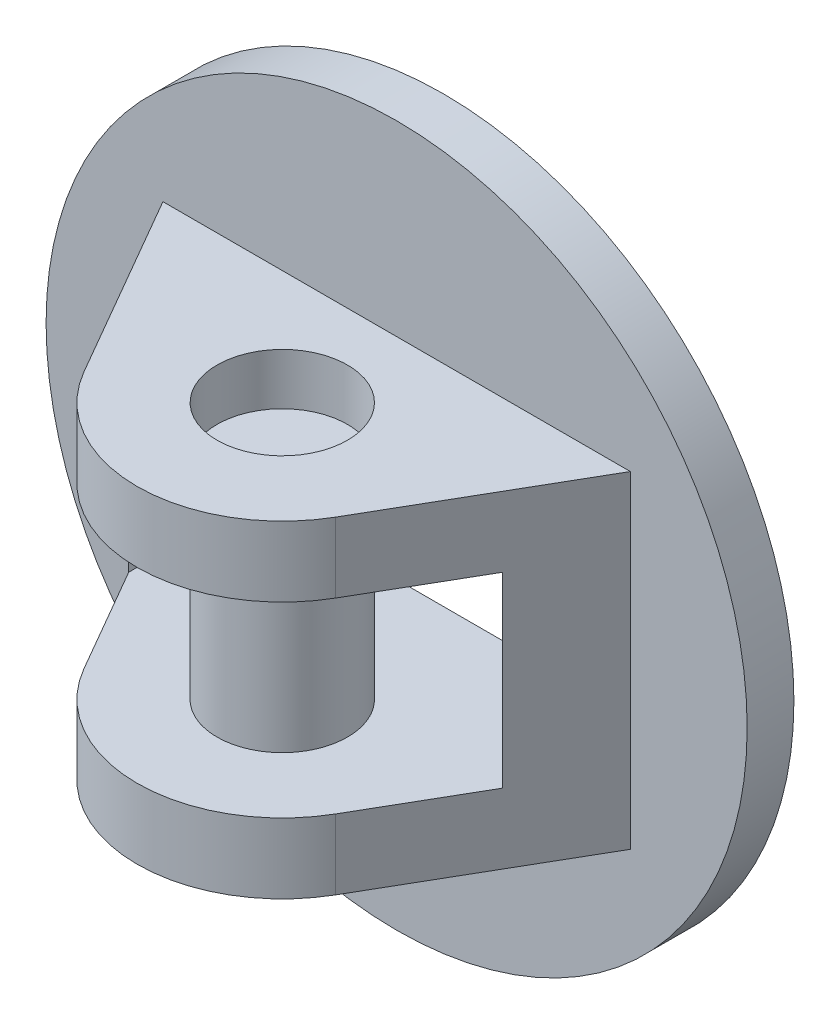
ISO-10303-21;
HEADER;
FILE_DESCRIPTION(('STEP AP214'),'2;1');
FILE_NAME('part.step','',(''),(''),'','','');
FILE_SCHEMA(('AUTOMOTIVE_DESIGN { 1 0 10303 214 1 1 1 1 }'));
ENDSEC;
DATA;
#1=APPLICATION_CONTEXT('core data for automotive mechanical design processes');
#2=APPLICATION_PROTOCOL_DEFINITION('international standard','automotive_design',2000,#1);
#3=PRODUCT_CONTEXT('',#1,'mechanical');
#4=PRODUCT('Part','Part','',(#3));
#5=PRODUCT_RELATED_PRODUCT_CATEGORY('part','',(#4));
#6=PRODUCT_DEFINITION_FORMATION('','',#4);
#7=PRODUCT_DEFINITION_CONTEXT('part definition',#1,'design');
#8=PRODUCT_DEFINITION('design','',#6,#7);
#9=PRODUCT_DEFINITION_SHAPE('','',#8);
#10=(LENGTH_UNIT() NAMED_UNIT(*) SI_UNIT(.MILLI.,.METRE.));
#11=(NAMED_UNIT(*) PLANE_ANGLE_UNIT() SI_UNIT($,.RADIAN.));
#12=(NAMED_UNIT(*) SI_UNIT($,.STERADIAN.) SOLID_ANGLE_UNIT());
#13=UNCERTAINTY_MEASURE_WITH_UNIT(LENGTH_MEASURE(1.E-05),#10,'distance_accuracy_value','');
#14=(GEOMETRIC_REPRESENTATION_CONTEXT(3) GLOBAL_UNCERTAINTY_ASSIGNED_CONTEXT((#13)) GLOBAL_UNIT_ASSIGNED_CONTEXT((#10,
#11,#12)) REPRESENTATION_CONTEXT('',''));
#15=CARTESIAN_POINT('',(0.,0.,0.));
#16=DIRECTION('',(0.,0.,1.));
#17=DIRECTION('',(1.,0.,0.));
#18=AXIS2_PLACEMENT_3D('',#15,#16,#17);
#19=CARTESIAN_POINT('',(1.05818132034585E-13,12.,17.2329099369261));
#20=DIRECTION('',(0.,-1.,0.));
#21=DIRECTION('',(0.,0.,-1.));
#22=AXIS2_PLACEMENT_3D('',#19,#20,#21);
#23=CYLINDRICAL_SURFACE('',#22,6.975);
#24=CARTESIAN_POINT('',(1.05818132034585E-13,12.,17.2329099369261));
#25=DIRECTION('',(0.,1.,0.));
#26=DIRECTION('',(0.,0.,1.));
#27=AXIS2_PLACEMENT_3D('',#24,#25,#26);
#28=CIRCLE('',#27,6.975);
#29=CARTESIAN_POINT('',(1.05818132034585E-13,12.,24.2079099369261));
#30=VERTEX_POINT('',#29);
#31=EDGE_CURVE('E11',#30,#30,#28,.T.);
#32=ORIENTED_EDGE('',*,*,#31,.F.);
#33=EDGE_LOOP('',(#32));
#34=FACE_BOUND('',#33,.T.);
#35=CARTESIAN_POINT('',(1.05818132034585E-13,-12.,17.2329099369261));
#36=DIRECTION('',(0.,1.,0.));
#37=DIRECTION('',(0.,0.,1.));
#38=AXIS2_PLACEMENT_3D('',#35,#36,#37);
#39=CIRCLE('',#38,6.975);
#40=CARTESIAN_POINT('',(1.05818132034585E-13,-12.,24.2079099369261));
#41=VERTEX_POINT('',#40);
#42=EDGE_CURVE('E56',#41,#41,#39,.T.);
#43=ORIENTED_EDGE('',*,*,#42,.T.);
#44=EDGE_LOOP('',(#43));
#45=FACE_BOUND('',#44,.T.);
#46=ADVANCED_FACE('F50',(#34,#45),#23,.T.);
#47=CARTESIAN_POINT('',(1.05818132034585E-13,12.,17.2329099369261));
#48=DIRECTION('',(0.,1.,0.));
#49=DIRECTION('',(0.,0.,1.));
#50=AXIS2_PLACEMENT_3D('',#47,#48,#49);
#51=PLANE('',#50);
#52=ORIENTED_EDGE('',*,*,#31,.T.);
#53=EDGE_LOOP('',(#52));
#54=FACE_BOUND('',#53,.T.);
#55=ADVANCED_FACE('F65',(#54),#51,.T.);
#56=CARTESIAN_POINT('',(1.05818132034585E-13,-12.,17.2329099369261));
#57=DIRECTION('',(0.,1.,0.));
#58=DIRECTION('',(0.,0.,1.));
#59=AXIS2_PLACEMENT_3D('',#56,#57,#58);
#60=PLANE('',#59);
#61=ORIENTED_EDGE('',*,*,#42,.F.);
#62=EDGE_LOOP('',(#61));
#63=FACE_BOUND('',#62,.T.);
#64=ADVANCED_FACE('F63',(#63),#60,.F.);
#65=CLOSED_SHELL('',(#46,#55,#64));
#66=MANIFOLD_SOLID_BREP('B2',#65);
#67=CARTESIAN_POINT('',(1.05818132034585E-13,17.5,17.2329099369261));
#68=DIRECTION('',(0.,-1.,0.));
#69=DIRECTION('',(0.,0.,-1.));
#70=AXIS2_PLACEMENT_3D('',#67,#68,#69);
#71=CYLINDRICAL_SURFACE('',#70,15.5341801261479);
#72=CARTESIAN_POINT('',(1.05818132034585E-13,-10.,17.2329099369261));
#73=DIRECTION('',(0.,-1.,0.));
#74=DIRECTION('',(0.,0.,-1.));
#75=AXIS2_PLACEMENT_3D('',#72,#73,#74);
#76=CIRCLE('',#75,15.5341801261479);
#77=CARTESIAN_POINT('',(13.4529946162076,-10.,25.));
#78=VERTEX_POINT('',#77);
#79=CARTESIAN_POINT('',(-13.4529946162074,-10.,25.));
#80=VERTEX_POINT('',#79);
#81=EDGE_CURVE('E217',#78,#80,#76,.T.);
#82=ORIENTED_EDGE('',*,*,#81,.T.);
#83=DIRECTION('',(0.,-1.,0.));
#84=VECTOR('',#83,1.);
#85=CARTESIAN_POINT('',(-13.4529946162074,17.5,25.));
#86=LINE('',#85,#84);
#87=CARTESIAN_POINT('',(-13.4529946162074,-17.5,25.));
#88=VERTEX_POINT('',#87);
#89=EDGE_CURVE('E268',#80,#88,#86,.T.);
#90=ORIENTED_EDGE('',*,*,#89,.T.);
#91=CARTESIAN_POINT('',(1.05818132034585E-13,-17.5,17.2329099369261));
#92=DIRECTION('',(0.,1.,0.));
#93=DIRECTION('',(0.,0.,-1.));
#94=AXIS2_PLACEMENT_3D('',#91,#92,#93);
#95=CIRCLE('',#94,15.5341801261479);
#96=CARTESIAN_POINT('',(13.4529946162076,-17.5,25.));
#97=VERTEX_POINT('',#96);
#98=EDGE_CURVE('E245',#88,#97,#95,.T.);
#99=ORIENTED_EDGE('',*,*,#98,.T.);
#100=DIRECTION('',(0.,-1.,0.));
#101=VECTOR('',#100,1.);
#102=CARTESIAN_POINT('',(13.4529946162076,17.5,25.));
#103=LINE('',#102,#101);
#104=EDGE_CURVE('E252',#78,#97,#103,.T.);
#105=ORIENTED_EDGE('',*,*,#104,.F.);
#106=EDGE_LOOP('',(#82,#90,#99,#105));
#107=FACE_BOUND('',#106,.T.);
#108=ADVANCED_FACE('F106',(#107),#71,.T.);
#109=CARTESIAN_POINT('',(1.05818132034585E-13,17.5,17.2329099369261));
#110=DIRECTION('',(0.,-1.,0.));
#111=DIRECTION('',(0.,0.,-1.));
#112=AXIS2_PLACEMENT_3D('',#109,#110,#111);
#113=CYLINDRICAL_SURFACE('',#112,6.97551566605455);
#114=CARTESIAN_POINT('',(1.05818132034585E-13,9.99999999999999,17.2329099369261));
#115=DIRECTION('',(0.,1.,0.));
#116=DIRECTION('',(0.,0.,1.));
#117=AXIS2_PLACEMENT_3D('',#114,#115,#116);
#118=CIRCLE('',#117,6.97551566605455);
#119=CARTESIAN_POINT('',(1.05818132034585E-13,9.99999999999999,24.2084256029807));
#120=VERTEX_POINT('',#119);
#121=EDGE_CURVE('E224',#120,#120,#118,.T.);
#122=ORIENTED_EDGE('',*,*,#121,.F.);
#123=EDGE_LOOP('',(#122));
#124=FACE_BOUND('',#123,.T.);
#125=CARTESIAN_POINT('',(1.05818132034585E-13,17.5,17.2329099369261));
#126=DIRECTION('',(0.,1.,0.));
#127=DIRECTION('',(0.,0.,1.));
#128=AXIS2_PLACEMENT_3D('',#125,#126,#127);
#129=CIRCLE('',#128,6.97551566605455);
#130=CARTESIAN_POINT('',(1.05818132034585E-13,17.5,24.2084256029807));
#131=VERTEX_POINT('',#130);
#132=EDGE_CURVE('E235',#131,#131,#129,.T.);
#133=ORIENTED_EDGE('',*,*,#132,.T.);
#134=EDGE_LOOP('',(#133));
#135=FACE_BOUND('',#134,.T.);
#136=ADVANCED_FACE('F329',(#124,#135),#113,.F.);
#137=CARTESIAN_POINT('',(0.,0.,5.00000000000002));
#138=DIRECTION('',(0.,0.,1.));
#139=DIRECTION('',(1.,0.,0.));
#140=AXIS2_PLACEMENT_3D('',#137,#138,#139);
#141=PLANE('',#140);
#142=CARTESIAN_POINT('',(0.,0.,5.00000000000002));
#143=DIRECTION('',(0.,0.,1.));
#144=DIRECTION('',(1.,0.,0.));
#145=AXIS2_PLACEMENT_3D('',#142,#143,#144);
#146=CIRCLE('',#145,37.5);
#147=CARTESIAN_POINT('',(37.5,0.,5.00000000000002));
#148=VERTEX_POINT('',#147);
#149=EDGE_CURVE('E281',#148,#148,#146,.T.);
#150=ORIENTED_EDGE('',*,*,#149,.T.);
#151=EDGE_LOOP('',(#150));
#152=FACE_BOUND('',#151,.T.);
#153=DIRECTION('',(-1.,0.,0.));
#154=VECTOR('',#153,1.);
#155=CARTESIAN_POINT('',(25.,17.5,5.00000000000002));
#156=LINE('',#155,#154);
#157=CARTESIAN_POINT('',(25.,17.5,5.00000000000002));
#158=VERTEX_POINT('',#157);
#159=CARTESIAN_POINT('',(-25.,17.5,5.00000000000002));
#160=VERTEX_POINT('',#159);
#161=EDGE_CURVE('E244',#158,#160,#156,.T.);
#162=ORIENTED_EDGE('',*,*,#161,.F.);
#163=DIRECTION('',(0.,-1.,0.));
#164=VECTOR('',#163,1.);
#165=CARTESIAN_POINT('',(25.,17.5,5.00000000000002));
#166=LINE('',#165,#164);
#167=CARTESIAN_POINT('',(25.,-17.5,5.00000000000002));
#168=VERTEX_POINT('',#167);
#169=EDGE_CURVE('E276',#158,#168,#166,.T.);
#170=ORIENTED_EDGE('',*,*,#169,.T.);
#171=DIRECTION('',(-1.,0.,0.));
#172=VECTOR('',#171,1.);
#173=CARTESIAN_POINT('',(25.,-17.5,5.00000000000002));
#174=LINE('',#173,#172);
#175=CARTESIAN_POINT('',(-25.,-17.5,5.00000000000002));
#176=VERTEX_POINT('',#175);
#177=EDGE_CURVE('E255',#168,#176,#174,.T.);
#178=ORIENTED_EDGE('',*,*,#177,.T.);
#179=DIRECTION('',(0.,-1.,0.));
#180=VECTOR('',#179,1.);
#181=CARTESIAN_POINT('',(-25.,17.5,5.00000000000002));
#182=LINE('',#181,#180);
#183=EDGE_CURVE('E273',#160,#176,#182,.T.);
#184=ORIENTED_EDGE('',*,*,#183,.F.);
#185=EDGE_LOOP('',(#162,#170,#178,#184));
#186=FACE_BOUND('',#185,.T.);
#187=ADVANCED_FACE('F307',(#152,#186),#141,.T.);
#188=CARTESIAN_POINT('',(0.,0.,5.00000000000002));
#189=DIRECTION('',(0.,0.,-1.));
#190=DIRECTION('',(-1.,0.,0.));
#191=AXIS2_PLACEMENT_3D('',#188,#189,#190);
#192=CYLINDRICAL_SURFACE('',#191,37.5);
#193=ORIENTED_EDGE('',*,*,#149,.F.);
#194=EDGE_LOOP('',(#193));
#195=FACE_BOUND('',#194,.T.);
#196=CARTESIAN_POINT('',(0.,0.,0.));
#197=DIRECTION('',(0.,0.,1.));
#198=DIRECTION('',(1.,0.,0.));
#199=AXIS2_PLACEMENT_3D('',#196,#197,#198);
#200=CIRCLE('',#199,37.5);
#201=CARTESIAN_POINT('',(37.5,0.,0.));
#202=VERTEX_POINT('',#201);
#203=EDGE_CURVE('E280',#202,#202,#200,.T.);
#204=ORIENTED_EDGE('',*,*,#203,.T.);
#205=EDGE_LOOP('',(#204));
#206=FACE_BOUND('',#205,.T.);
#207=ADVANCED_FACE('F108',(#195,#206),#192,.T.);
#208=CARTESIAN_POINT('',(0.,0.,0.));
#209=DIRECTION('',(0.,0.,1.));
#210=DIRECTION('',(1.,0.,0.));
#211=AXIS2_PLACEMENT_3D('',#208,#209,#210);
#212=PLANE('',#211);
#213=DIRECTION('',(-1.,0.,0.));
#214=VECTOR('',#213,1.);
#215=CARTESIAN_POINT('',(-20.,9.99999999999999,0.));
#216=LINE('',#215,#214);
#217=CARTESIAN_POINT('',(20.,9.99999999999999,0.));
#218=VERTEX_POINT('',#217);
#219=CARTESIAN_POINT('',(-20.,9.99999999999999,0.));
#220=VERTEX_POINT('',#219);
#221=EDGE_CURVE('E196',#218,#220,#216,.T.);
#222=ORIENTED_EDGE('',*,*,#221,.T.);
#223=DIRECTION('',(0.,-1.,0.));
#224=VECTOR('',#223,1.);
#225=CARTESIAN_POINT('',(-20.,9.99999999999999,0.));
#226=LINE('',#225,#224);
#227=CARTESIAN_POINT('',(-20.,-10.,0.));
#228=VERTEX_POINT('',#227);
#229=EDGE_CURVE('E189',#220,#228,#226,.T.);
#230=ORIENTED_EDGE('',*,*,#229,.T.);
#231=DIRECTION('',(1.,0.,0.));
#232=VECTOR('',#231,1.);
#233=CARTESIAN_POINT('',(-20.,-10.,0.));
#234=LINE('',#233,#232);
#235=CARTESIAN_POINT('',(20.,-10.,0.));
#236=VERTEX_POINT('',#235);
#237=EDGE_CURVE('E199',#228,#236,#234,.T.);
#238=ORIENTED_EDGE('',*,*,#237,.T.);
#239=DIRECTION('',(0.,1.,0.));
#240=VECTOR('',#239,1.);
#241=CARTESIAN_POINT('',(20.,9.99999999999999,0.));
#242=LINE('',#241,#240);
#243=EDGE_CURVE('E121',#236,#218,#242,.T.);
#244=ORIENTED_EDGE('',*,*,#243,.T.);
#245=EDGE_LOOP('',(#222,#230,#238,#244));
#246=FACE_BOUND('',#245,.T.);
#247=ORIENTED_EDGE('',*,*,#203,.F.);
#248=EDGE_LOOP('',(#247));
#249=FACE_BOUND('',#248,.T.);
#250=ADVANCED_FACE('F203',(#246,#249),#212,.F.);
#251=CARTESIAN_POINT('',(1.05818132034585E-13,17.5,17.2329099369261));
#252=DIRECTION('',(0.,-1.,0.));
#253=DIRECTION('',(0.,0.,-1.));
#254=AXIS2_PLACEMENT_3D('',#251,#252,#253);
#255=PLANE('',#254);
#256=DIRECTION('',(0.499999999999998,0.,-0.86602540378444));
#257=VECTOR('',#256,1.);
#258=CARTESIAN_POINT('',(25.,17.5,5.00000000000002));
#259=LINE('',#258,#257);
#260=CARTESIAN_POINT('',(13.4529946162076,17.5,25.));
#261=VERTEX_POINT('',#260);
#262=EDGE_CURVE('E242',#261,#158,#259,.T.);
#263=ORIENTED_EDGE('',*,*,#262,.T.);
#264=ORIENTED_EDGE('',*,*,#161,.T.);
#265=DIRECTION('',(0.500000000000004,0.,0.866025403784436));
#266=VECTOR('',#265,1.);
#267=CARTESIAN_POINT('',(-25.,17.5,5.00000000000002));
#268=LINE('',#267,#266);
#269=CARTESIAN_POINT('',(-13.4529946162074,17.5,25.));
#270=VERTEX_POINT('',#269);
#271=EDGE_CURVE('E129',#160,#270,#268,.T.);
#272=ORIENTED_EDGE('',*,*,#271,.T.);
#273=CARTESIAN_POINT('',(1.05818132034585E-13,17.5,17.2329099369261));
#274=DIRECTION('',(0.,1.,0.));
#275=DIRECTION('',(0.,0.,-1.));
#276=AXIS2_PLACEMENT_3D('',#273,#274,#275);
#277=CIRCLE('',#276,15.5341801261479);
#278=EDGE_CURVE('E249',#270,#261,#277,.T.);
#279=ORIENTED_EDGE('',*,*,#278,.T.);
#280=EDGE_LOOP('',(#263,#264,#272,#279));
#281=FACE_BOUND('',#280,.T.);
#282=ORIENTED_EDGE('',*,*,#132,.F.);
#283=EDGE_LOOP('',(#282));
#284=FACE_BOUND('',#283,.T.);
#285=ADVANCED_FACE('F310',(#281,#284),#255,.F.);
#286=CARTESIAN_POINT('',(1.05818132034585E-13,-17.5,17.2329099369261));
#287=DIRECTION('',(0.,-1.,0.));
#288=DIRECTION('',(0.,0.,-1.));
#289=AXIS2_PLACEMENT_3D('',#286,#287,#288);
#290=PLANE('',#289);
#291=DIRECTION('',(0.499999999999998,0.,-0.86602540378444));
#292=VECTOR('',#291,1.);
#293=CARTESIAN_POINT('',(25.,-17.5,5.00000000000002));
#294=LINE('',#293,#292);
#295=EDGE_CURVE('E239',#97,#168,#294,.T.);
#296=ORIENTED_EDGE('',*,*,#295,.F.);
#297=ORIENTED_EDGE('',*,*,#98,.F.);
#298=DIRECTION('',(0.500000000000004,0.,0.866025403784436));
#299=VECTOR('',#298,1.);
#300=CARTESIAN_POINT('',(-25.,-17.5,5.00000000000002));
#301=LINE('',#300,#299);
#302=EDGE_CURVE('E258',#176,#88,#301,.T.);
#303=ORIENTED_EDGE('',*,*,#302,.F.);
#304=ORIENTED_EDGE('',*,*,#177,.F.);
#305=EDGE_LOOP('',(#296,#297,#303,#304));
#306=FACE_BOUND('',#305,.T.);
#307=CARTESIAN_POINT('',(1.05818132034585E-13,-17.5,17.2329099369261));
#308=DIRECTION('',(0.,1.,0.));
#309=DIRECTION('',(0.,0.,1.));
#310=AXIS2_PLACEMENT_3D('',#307,#308,#309);
#311=CIRCLE('',#310,6.97551566605455);
#312=CARTESIAN_POINT('',(1.05818132034585E-13,-17.5,24.2084256029807));
#313=VERTEX_POINT('',#312);
#314=EDGE_CURVE('E234',#313,#313,#311,.T.);
#315=ORIENTED_EDGE('',*,*,#314,.T.);
#316=EDGE_LOOP('',(#315));
#317=FACE_BOUND('',#316,.T.);
#318=ADVANCED_FACE('F301',(#306,#317),#290,.T.);
#319=CARTESIAN_POINT('',(25.,17.5,5.00000000000002));
#320=DIRECTION('',(-0.86602540378444,0.,-0.499999999999998));
#321=DIRECTION('',(-0.499999999999998,0.,0.86602540378444));
#322=AXIS2_PLACEMENT_3D('',#319,#320,#321);
#323=PLANE('',#322);
#324=CARTESIAN_POINT('',(13.4529946162076,9.99999999999999,25.));
#325=VERTEX_POINT('',#324);
#326=EDGE_CURVE('E264',#261,#325,#103,.T.);
#327=ORIENTED_EDGE('',*,*,#326,.T.);
#328=DIRECTION('',(0.499999999999998,0.,-0.86602540378444));
#329=VECTOR('',#328,1.);
#330=CARTESIAN_POINT('',(25.,9.99999999999999,5.00000000000002));
#331=LINE('',#330,#329);
#332=CARTESIAN_POINT('',(20.,9.99999999999999,13.6602540378445));
#333=VERTEX_POINT('',#332);
#334=EDGE_CURVE('E231',#325,#333,#331,.T.);
#335=ORIENTED_EDGE('',*,*,#334,.T.);
#336=DIRECTION('',(0.,-1.,0.));
#337=VECTOR('',#336,1.);
#338=CARTESIAN_POINT('',(20.,17.5,13.6602540378445));
#339=LINE('',#338,#337);
#340=CARTESIAN_POINT('',(20.,-10.,13.6602540378445));
#341=VERTEX_POINT('',#340);
#342=EDGE_CURVE('E48',#333,#341,#339,.T.);
#343=ORIENTED_EDGE('',*,*,#342,.T.);
#344=DIRECTION('',(-0.499999999999998,0.,0.86602540378444));
#345=VECTOR('',#344,1.);
#346=CARTESIAN_POINT('',(25.,-10.,5.00000000000002));
#347=LINE('',#346,#345);
#348=EDGE_CURVE('E221',#341,#78,#347,.T.);
#349=ORIENTED_EDGE('',*,*,#348,.T.);
#350=ORIENTED_EDGE('',*,*,#104,.T.);
#351=ORIENTED_EDGE('',*,*,#295,.T.);
#352=ORIENTED_EDGE('',*,*,#169,.F.);
#353=ORIENTED_EDGE('',*,*,#262,.F.);
#354=EDGE_LOOP('',(#327,#335,#343,#349,#350,#351,#352,#353));
#355=FACE_BOUND('',#354,.T.);
#356=ADVANCED_FACE('F296',(#355),#323,.F.);
#357=CARTESIAN_POINT('',(-25.,17.5,5.00000000000002));
#358=DIRECTION('',(0.866025403784436,0.,-0.500000000000004));
#359=DIRECTION('',(-0.500000000000004,0.,-0.866025403784436));
#360=AXIS2_PLACEMENT_3D('',#357,#358,#359);
#361=PLANE('',#360);
#362=DIRECTION('',(0.,1.,0.));
#363=VECTOR('',#362,1.);
#364=CARTESIAN_POINT('',(-20.,17.5,13.6602540378443));
#365=LINE('',#364,#363);
#366=CARTESIAN_POINT('',(-20.,-10.,13.6602540378443));
#367=VERTEX_POINT('',#366);
#368=CARTESIAN_POINT('',(-20.,9.99999999999999,13.6602540378443));
#369=VERTEX_POINT('',#368);
#370=EDGE_CURVE('E114',#367,#369,#365,.T.);
#371=ORIENTED_EDGE('',*,*,#370,.T.);
#372=DIRECTION('',(0.500000000000004,0.,0.866025403784436));
#373=VECTOR('',#372,1.);
#374=CARTESIAN_POINT('',(-25.,9.99999999999999,5.00000000000002));
#375=LINE('',#374,#373);
#376=CARTESIAN_POINT('',(-13.4529946162074,9.99999999999999,25.));
#377=VERTEX_POINT('',#376);
#378=EDGE_CURVE('E228',#369,#377,#375,.T.);
#379=ORIENTED_EDGE('',*,*,#378,.T.);
#380=EDGE_CURVE('E269',#270,#377,#86,.T.);
#381=ORIENTED_EDGE('',*,*,#380,.F.);
#382=ORIENTED_EDGE('',*,*,#271,.F.);
#383=ORIENTED_EDGE('',*,*,#183,.T.);
#384=ORIENTED_EDGE('',*,*,#302,.T.);
#385=ORIENTED_EDGE('',*,*,#89,.F.);
#386=DIRECTION('',(-0.500000000000004,0.,-0.866025403784436));
#387=VECTOR('',#386,1.);
#388=CARTESIAN_POINT('',(-25.,-10.,5.00000000000002));
#389=LINE('',#388,#387);
#390=EDGE_CURVE('E219',#80,#367,#389,.T.);
#391=ORIENTED_EDGE('',*,*,#390,.T.);
#392=EDGE_LOOP('',(#371,#379,#381,#382,#383,#384,#385,#391));
#393=FACE_BOUND('',#392,.T.);
#394=ADVANCED_FACE('F291',(#393),#361,.F.);
#395=ORIENTED_EDGE('',*,*,#380,.T.);
#396=CARTESIAN_POINT('',(1.05818132034585E-13,9.99999999999999,17.2329099369261));
#397=DIRECTION('',(0.,1.,0.));
#398=DIRECTION('',(0.,0.,1.));
#399=AXIS2_PLACEMENT_3D('',#396,#397,#398);
#400=CIRCLE('',#399,15.5341801261479);
#401=EDGE_CURVE('E225',#377,#325,#400,.T.);
#402=ORIENTED_EDGE('',*,*,#401,.T.);
#403=ORIENTED_EDGE('',*,*,#326,.F.);
#404=ORIENTED_EDGE('',*,*,#278,.F.);
#405=EDGE_LOOP('',(#395,#402,#403,#404));
#406=FACE_BOUND('',#405,.T.);
#407=ADVANCED_FACE('F315',(#406),#71,.T.);
#408=CARTESIAN_POINT('',(1.05818132034585E-13,-10.,17.2329099369261));
#409=DIRECTION('',(0.,-1.,0.));
#410=DIRECTION('',(0.,0.,-1.));
#411=AXIS2_PLACEMENT_3D('',#408,#409,#410);
#412=CIRCLE('',#411,6.97551566605455);
#413=CARTESIAN_POINT('',(1.05818132034585E-13,-10.,10.2573942708716));
#414=VERTEX_POINT('',#413);
#415=EDGE_CURVE('E212',#414,#414,#412,.T.);
#416=ORIENTED_EDGE('',*,*,#415,.F.);
#417=EDGE_LOOP('',(#416));
#418=FACE_BOUND('',#417,.T.);
#419=ORIENTED_EDGE('',*,*,#314,.F.);
#420=EDGE_LOOP('',(#419));
#421=FACE_BOUND('',#420,.T.);
#422=ADVANCED_FACE('F320',(#418,#421),#113,.F.);
#423=CARTESIAN_POINT('',(20.,9.99999999999999,0.));
#424=DIRECTION('',(1.,0.,0.));
#425=DIRECTION('',(0.,0.,-1.));
#426=AXIS2_PLACEMENT_3D('',#423,#424,#425);
#427=PLANE('',#426);
#428=DIRECTION('',(0.,0.,1.));
#429=VECTOR('',#428,1.);
#430=CARTESIAN_POINT('',(20.,9.99999999999999,0.));
#431=LINE('',#430,#429);
#432=EDGE_CURVE('E213',#218,#333,#431,.T.);
#433=ORIENTED_EDGE('',*,*,#432,.F.);
#434=ORIENTED_EDGE('',*,*,#243,.F.);
#435=DIRECTION('',(0.,0.,1.));
#436=VECTOR('',#435,1.);
#437=CARTESIAN_POINT('',(20.,-10.,0.));
#438=LINE('',#437,#436);
#439=EDGE_CURVE('E195',#236,#341,#438,.T.);
#440=ORIENTED_EDGE('',*,*,#439,.T.);
#441=ORIENTED_EDGE('',*,*,#342,.F.);
#442=EDGE_LOOP('',(#433,#434,#440,#441));
#443=FACE_BOUND('',#442,.T.);
#444=ADVANCED_FACE('F318',(#443),#427,.F.);
#445=CARTESIAN_POINT('',(-20.,9.99999999999999,0.));
#446=DIRECTION('',(-1.,0.,0.));
#447=DIRECTION('',(0.,-1.,0.));
#448=AXIS2_PLACEMENT_3D('',#445,#446,#447);
#449=PLANE('',#448);
#450=DIRECTION('',(0.,0.,1.));
#451=VECTOR('',#450,1.);
#452=CARTESIAN_POINT('',(-20.,-10.,0.));
#453=LINE('',#452,#451);
#454=EDGE_CURVE('E184',#228,#367,#453,.T.);
#455=ORIENTED_EDGE('',*,*,#454,.F.);
#456=ORIENTED_EDGE('',*,*,#229,.F.);
#457=DIRECTION('',(0.,0.,1.));
#458=VECTOR('',#457,1.);
#459=CARTESIAN_POINT('',(-20.,9.99999999999999,0.));
#460=LINE('',#459,#458);
#461=EDGE_CURVE('E210',#220,#369,#460,.T.);
#462=ORIENTED_EDGE('',*,*,#461,.T.);
#463=ORIENTED_EDGE('',*,*,#370,.F.);
#464=EDGE_LOOP('',(#455,#456,#462,#463));
#465=FACE_BOUND('',#464,.T.);
#466=ADVANCED_FACE('F186',(#465),#449,.F.);
#467=CARTESIAN_POINT('',(-20.,9.99999999999999,0.));
#468=DIRECTION('',(0.,1.,0.));
#469=DIRECTION('',(0.,0.,1.));
#470=AXIS2_PLACEMENT_3D('',#467,#468,#469);
#471=PLANE('',#470);
#472=ORIENTED_EDGE('',*,*,#121,.T.);
#473=EDGE_LOOP('',(#472));
#474=FACE_BOUND('',#473,.T.);
#475=ORIENTED_EDGE('',*,*,#401,.F.);
#476=ORIENTED_EDGE('',*,*,#378,.F.);
#477=ORIENTED_EDGE('',*,*,#461,.F.);
#478=ORIENTED_EDGE('',*,*,#221,.F.);
#479=ORIENTED_EDGE('',*,*,#432,.T.);
#480=ORIENTED_EDGE('',*,*,#334,.F.);
#481=EDGE_LOOP('',(#475,#476,#477,#478,#479,#480));
#482=FACE_BOUND('',#481,.T.);
#483=ADVANCED_FACE('F317',(#474,#482),#471,.F.);
#484=CARTESIAN_POINT('',(-20.,-10.,0.));
#485=DIRECTION('',(0.,-1.,0.));
#486=DIRECTION('',(0.,0.,-1.));
#487=AXIS2_PLACEMENT_3D('',#484,#485,#486);
#488=PLANE('',#487);
#489=ORIENTED_EDGE('',*,*,#415,.T.);
#490=EDGE_LOOP('',(#489));
#491=FACE_BOUND('',#490,.T.);
#492=ORIENTED_EDGE('',*,*,#439,.F.);
#493=ORIENTED_EDGE('',*,*,#237,.F.);
#494=ORIENTED_EDGE('',*,*,#454,.T.);
#495=ORIENTED_EDGE('',*,*,#390,.F.);
#496=ORIENTED_EDGE('',*,*,#81,.F.);
#497=ORIENTED_EDGE('',*,*,#348,.F.);
#498=EDGE_LOOP('',(#492,#493,#494,#495,#496,#497));
#499=FACE_BOUND('',#498,.T.);
#500=ADVANCED_FACE('F200',(#491,#499),#488,.F.);
#501=CLOSED_SHELL('',(#108,#136,#187,#207,#250,#285,#318,#356,#394,#407,#422,#444,#466,#483,#500));
#502=MANIFOLD_SOLID_BREP('B6',#501);
#503=ADVANCED_BREP_SHAPE_REPRESENTATION('',(#18,#66,#502),#14);
#504=SHAPE_DEFINITION_REPRESENTATION(#9,#503);
ENDSEC;
END-ISO-10303-21;
